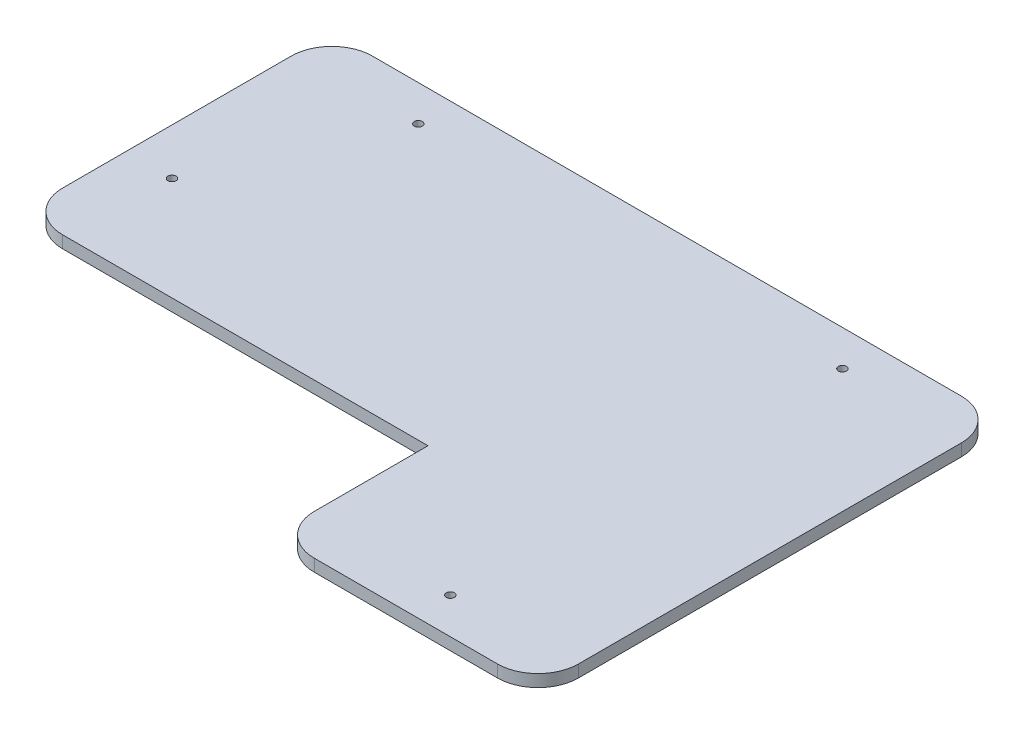
ISO-10303-21;
HEADER;
FILE_DESCRIPTION(('STEP AP214'),'2;1');
FILE_NAME('part.step','',(''),(''),'','','');
FILE_SCHEMA(('AUTOMOTIVE_DESIGN { 1 0 10303 214 1 1 1 1 }'));
ENDSEC;
DATA;
#1=APPLICATION_CONTEXT('core data for automotive mechanical design processes');
#2=APPLICATION_PROTOCOL_DEFINITION('international standard','automotive_design',2000,#1);
#3=PRODUCT_CONTEXT('',#1,'mechanical');
#4=PRODUCT('Part','Part','',(#3));
#5=PRODUCT_RELATED_PRODUCT_CATEGORY('part','',(#4));
#6=PRODUCT_DEFINITION_FORMATION('','',#4);
#7=PRODUCT_DEFINITION_CONTEXT('part definition',#1,'design');
#8=PRODUCT_DEFINITION('design','',#6,#7);
#9=PRODUCT_DEFINITION_SHAPE('','',#8);
#10=(LENGTH_UNIT() NAMED_UNIT(*) SI_UNIT(.MILLI.,.METRE.));
#11=(NAMED_UNIT(*) PLANE_ANGLE_UNIT() SI_UNIT($,.RADIAN.));
#12=(NAMED_UNIT(*) SI_UNIT($,.STERADIAN.) SOLID_ANGLE_UNIT());
#13=UNCERTAINTY_MEASURE_WITH_UNIT(LENGTH_MEASURE(1.E-05),#10,'distance_accuracy_value','');
#14=(GEOMETRIC_REPRESENTATION_CONTEXT(3) GLOBAL_UNCERTAINTY_ASSIGNED_CONTEXT((#13)) GLOBAL_UNIT_ASSIGNED_CONTEXT((#10,
#11,#12)) REPRESENTATION_CONTEXT('',''));
#15=CARTESIAN_POINT('',(0.,0.,0.));
#16=DIRECTION('',(0.,0.,1.));
#17=DIRECTION('',(1.,0.,0.));
#18=AXIS2_PLACEMENT_3D('',#15,#16,#17);
#19=CARTESIAN_POINT('',(-82.55,3.,-57.15));
#20=DIRECTION('',(1.,0.,0.));
#21=DIRECTION('',(0.,0.,-1.));
#22=AXIS2_PLACEMENT_3D('',#19,#20,#21);
#23=PLANE('',#22);
#24=DIRECTION('',(0.,0.,1.));
#25=VECTOR('',#24,1.);
#26=CARTESIAN_POINT('',(-82.55,0.,-57.15));
#27=LINE('',#26,#25);
#28=CARTESIAN_POINT('',(-82.55,0.,-47.15));
#29=VERTEX_POINT('',#28);
#30=CARTESIAN_POINT('',(-82.55,0.,9.15000000000001));
#31=VERTEX_POINT('',#30);
#32=EDGE_CURVE('E139',#29,#31,#27,.T.);
#33=ORIENTED_EDGE('',*,*,#32,.T.);
#34=DIRECTION('',(0.,1.,0.));
#35=VECTOR('',#34,1.);
#36=CARTESIAN_POINT('',(-82.55,3.,9.15000000000001));
#37=LINE('',#36,#35);
#38=CARTESIAN_POINT('',(-82.55,3.,9.15000000000001));
#39=VERTEX_POINT('',#38);
#40=EDGE_CURVE('E195',#31,#39,#37,.T.);
#41=ORIENTED_EDGE('',*,*,#40,.T.);
#42=DIRECTION('',(0.,0.,1.));
#43=VECTOR('',#42,1.);
#44=CARTESIAN_POINT('',(-82.55,3.,-57.15));
#45=LINE('',#44,#43);
#46=CARTESIAN_POINT('',(-82.55,3.,-47.15));
#47=VERTEX_POINT('',#46);
#48=EDGE_CURVE('E149',#47,#39,#45,.T.);
#49=ORIENTED_EDGE('',*,*,#48,.F.);
#50=DIRECTION('',(0.,-1.,0.));
#51=VECTOR('',#50,1.);
#52=CARTESIAN_POINT('',(-82.55,3.,-47.15));
#53=LINE('',#52,#51);
#54=EDGE_CURVE('E192',#47,#29,#53,.T.);
#55=ORIENTED_EDGE('',*,*,#54,.T.);
#56=EDGE_LOOP('',(#33,#41,#49,#55));
#57=FACE_BOUND('',#56,.T.);
#58=ADVANCED_FACE('F35',(#57),#23,.F.);
#59=CARTESIAN_POINT('',(82.55,3.,57.15));
#60=DIRECTION('',(0.,0.,-1.));
#61=DIRECTION('',(-1.,0.,0.));
#62=AXIS2_PLACEMENT_3D('',#59,#60,#61);
#63=PLANE('',#62);
#64=DIRECTION('',(1.,0.,0.));
#65=VECTOR('',#64,1.);
#66=CARTESIAN_POINT('',(82.55,3.,57.15));
#67=LINE('',#66,#65);
#68=CARTESIAN_POINT('',(27.45,3.,57.15));
#69=VERTEX_POINT('',#68);
#70=CARTESIAN_POINT('',(72.55,3.,57.15));
#71=VERTEX_POINT('',#70);
#72=EDGE_CURVE('E151',#69,#71,#67,.T.);
#73=ORIENTED_EDGE('',*,*,#72,.F.);
#74=DIRECTION('',(0.,1.,0.));
#75=VECTOR('',#74,1.);
#76=CARTESIAN_POINT('',(27.45,3.,57.15));
#77=LINE('',#76,#75);
#78=CARTESIAN_POINT('',(27.45,0.,57.15));
#79=VERTEX_POINT('',#78);
#80=EDGE_CURVE('E182',#69,#79,#77,.F.);
#81=ORIENTED_EDGE('',*,*,#80,.T.);
#82=DIRECTION('',(1.,0.,0.));
#83=VECTOR('',#82,1.);
#84=CARTESIAN_POINT('',(82.55,0.,57.15));
#85=LINE('',#84,#83);
#86=CARTESIAN_POINT('',(72.55,0.,57.15));
#87=VERTEX_POINT('',#86);
#88=EDGE_CURVE('E163',#79,#87,#85,.T.);
#89=ORIENTED_EDGE('',*,*,#88,.T.);
#90=DIRECTION('',(0.,-1.,0.));
#91=VECTOR('',#90,1.);
#92=CARTESIAN_POINT('',(72.55,3.,57.15));
#93=LINE('',#92,#91);
#94=EDGE_CURVE('E180',#87,#71,#93,.F.);
#95=ORIENTED_EDGE('',*,*,#94,.T.);
#96=EDGE_LOOP('',(#73,#81,#89,#95));
#97=FACE_BOUND('',#96,.T.);
#98=ADVANCED_FACE('F214',(#97),#63,.F.);
#99=CARTESIAN_POINT('',(82.55,3.,-57.15));
#100=DIRECTION('',(-1.,0.,0.));
#101=DIRECTION('',(0.,0.,1.));
#102=AXIS2_PLACEMENT_3D('',#99,#100,#101);
#103=PLANE('',#102);
#104=DIRECTION('',(0.,0.,-1.));
#105=VECTOR('',#104,1.);
#106=CARTESIAN_POINT('',(82.55,0.,-57.15));
#107=LINE('',#106,#105);
#108=CARTESIAN_POINT('',(82.55,0.,47.15));
#109=VERTEX_POINT('',#108);
#110=CARTESIAN_POINT('',(82.55,0.,-47.15));
#111=VERTEX_POINT('',#110);
#112=EDGE_CURVE('E166',#109,#111,#107,.T.);
#113=ORIENTED_EDGE('',*,*,#112,.T.);
#114=DIRECTION('',(0.,-1.,0.));
#115=VECTOR('',#114,1.);
#116=CARTESIAN_POINT('',(82.55,3.,-47.15));
#117=LINE('',#116,#115);
#118=CARTESIAN_POINT('',(82.55,3.,-47.15));
#119=VERTEX_POINT('',#118);
#120=EDGE_CURVE('E11',#111,#119,#117,.F.);
#121=ORIENTED_EDGE('',*,*,#120,.T.);
#122=DIRECTION('',(0.,0.,-1.));
#123=VECTOR('',#122,1.);
#124=CARTESIAN_POINT('',(82.55,3.,-57.15));
#125=LINE('',#124,#123);
#126=CARTESIAN_POINT('',(82.55,3.,47.15));
#127=VERTEX_POINT('',#126);
#128=EDGE_CURVE('E155',#127,#119,#125,.T.);
#129=ORIENTED_EDGE('',*,*,#128,.F.);
#130=DIRECTION('',(0.,-1.,0.));
#131=VECTOR('',#130,1.);
#132=CARTESIAN_POINT('',(82.55,3.,47.15));
#133=LINE('',#132,#131);
#134=EDGE_CURVE('E43',#127,#109,#133,.T.);
#135=ORIENTED_EDGE('',*,*,#134,.T.);
#136=EDGE_LOOP('',(#113,#121,#129,#135));
#137=FACE_BOUND('',#136,.T.);
#138=ADVANCED_FACE('F206',(#137),#103,.F.);
#139=CARTESIAN_POINT('',(82.55,3.,-57.15));
#140=DIRECTION('',(0.,0.,1.));
#141=DIRECTION('',(1.,0.,0.));
#142=AXIS2_PLACEMENT_3D('',#139,#140,#141);
#143=PLANE('',#142);
#144=DIRECTION('',(-1.,0.,0.));
#145=VECTOR('',#144,1.);
#146=CARTESIAN_POINT('',(82.55,3.,-57.15));
#147=LINE('',#146,#145);
#148=CARTESIAN_POINT('',(72.55,3.,-57.15));
#149=VERTEX_POINT('',#148);
#150=CARTESIAN_POINT('',(-72.55,3.,-57.15));
#151=VERTEX_POINT('',#150);
#152=EDGE_CURVE('E158',#149,#151,#147,.T.);
#153=ORIENTED_EDGE('',*,*,#152,.F.);
#154=DIRECTION('',(0.,-1.,0.));
#155=VECTOR('',#154,1.);
#156=CARTESIAN_POINT('',(72.55,3.,-57.15));
#157=LINE('',#156,#155);
#158=CARTESIAN_POINT('',(72.55,0.,-57.15));
#159=VERTEX_POINT('',#158);
#160=EDGE_CURVE('E202',#149,#159,#157,.T.);
#161=ORIENTED_EDGE('',*,*,#160,.T.);
#162=DIRECTION('',(-1.,0.,0.));
#163=VECTOR('',#162,1.);
#164=CARTESIAN_POINT('',(82.55,0.,-57.15));
#165=LINE('',#164,#163);
#166=CARTESIAN_POINT('',(-72.55,0.,-57.15));
#167=VERTEX_POINT('',#166);
#168=EDGE_CURVE('E152',#159,#167,#165,.T.);
#169=ORIENTED_EDGE('',*,*,#168,.T.);
#170=DIRECTION('',(0.,-1.,0.));
#171=VECTOR('',#170,1.);
#172=CARTESIAN_POINT('',(-72.55,3.,-57.15));
#173=LINE('',#172,#171);
#174=EDGE_CURVE('E200',#167,#151,#173,.F.);
#175=ORIENTED_EDGE('',*,*,#174,.T.);
#176=EDGE_LOOP('',(#153,#161,#169,#175));
#177=FACE_BOUND('',#176,.T.);
#178=ADVANCED_FACE('F233',(#177),#143,.F.);
#179=CARTESIAN_POINT('',(0.,3.,0.));
#180=DIRECTION('',(0.,-1.,0.));
#181=DIRECTION('',(0.,0.,-1.));
#182=AXIS2_PLACEMENT_3D('',#179,#180,#181);
#183=PLANE('',#182);
#184=CARTESIAN_POINT('',(52.07,3.,48.26));
#185=DIRECTION('',(0.,1.,0.));
#186=DIRECTION('',(0.,0.,1.));
#187=AXIS2_PLACEMENT_3D('',#184,#185,#186);
#188=CIRCLE('',#187,1.);
#189=CARTESIAN_POINT('',(52.07,3.,49.26));
#190=VERTEX_POINT('',#189);
#191=EDGE_CURVE('E371',#190,#190,#188,.T.);
#192=ORIENTED_EDGE('',*,*,#191,.F.);
#193=EDGE_LOOP('',(#192));
#194=FACE_BOUND('',#193,.T.);
#195=CARTESIAN_POINT('',(52.0699999999997,3.,-48.34));
#196=DIRECTION('',(0.,1.,0.));
#197=DIRECTION('',(0.,0.,1.));
#198=AXIS2_PLACEMENT_3D('',#195,#196,#197);
#199=CIRCLE('',#198,1.);
#200=CARTESIAN_POINT('',(52.0699999999997,3.,-47.34));
#201=VERTEX_POINT('',#200);
#202=EDGE_CURVE('E373',#201,#201,#199,.T.);
#203=ORIENTED_EDGE('',*,*,#202,.F.);
#204=EDGE_LOOP('',(#203));
#205=FACE_BOUND('',#204,.T.);
#206=CARTESIAN_POINT('',(-71.12,3.,-6.35000000000001));
#207=DIRECTION('',(0.,1.,0.));
#208=DIRECTION('',(0.,0.,1.));
#209=AXIS2_PLACEMENT_3D('',#206,#207,#208);
#210=CIRCLE('',#209,1.);
#211=CARTESIAN_POINT('',(-71.12,3.,-5.35000000000001));
#212=VERTEX_POINT('',#211);
#213=EDGE_CURVE('E385',#212,#212,#210,.T.);
#214=ORIENTED_EDGE('',*,*,#213,.F.);
#215=EDGE_LOOP('',(#214));
#216=FACE_BOUND('',#215,.T.);
#217=CARTESIAN_POINT('',(-52.4300000000003,3.,-48.3399999999993));
#218=DIRECTION('',(0.,1.,0.));
#219=DIRECTION('',(0.,0.,1.));
#220=AXIS2_PLACEMENT_3D('',#217,#218,#219);
#221=CIRCLE('',#220,1.);
#222=CARTESIAN_POINT('',(-52.4300000000003,3.,-47.3399999999993));
#223=VERTEX_POINT('',#222);
#224=EDGE_CURVE('E379',#223,#223,#221,.T.);
#225=ORIENTED_EDGE('',*,*,#224,.F.);
#226=EDGE_LOOP('',(#225));
#227=FACE_BOUND('',#226,.T.);
#228=DIRECTION('',(0.,0.,-1.));
#229=VECTOR('',#228,1.);
#230=CARTESIAN_POINT('',(17.45,3.,57.15));
#231=LINE('',#230,#229);
#232=CARTESIAN_POINT('',(17.45,3.,47.15));
#233=VERTEX_POINT('',#232);
#234=CARTESIAN_POINT('',(17.45,3.,19.15));
#235=VERTEX_POINT('',#234);
#236=EDGE_CURVE('E120',#233,#235,#231,.T.);
#237=ORIENTED_EDGE('',*,*,#236,.F.);
#238=CARTESIAN_POINT('',(27.45,3.,47.15));
#239=DIRECTION('',(0.,-1.,0.));
#240=DIRECTION('',(0.,0.,-1.));
#241=AXIS2_PLACEMENT_3D('',#238,#239,#240);
#242=CIRCLE('',#241,10.);
#243=EDGE_CURVE('E178',#233,#69,#242,.F.);
#244=ORIENTED_EDGE('',*,*,#243,.T.);
#245=ORIENTED_EDGE('',*,*,#72,.T.);
#246=CARTESIAN_POINT('',(72.55,3.,47.15));
#247=DIRECTION('',(0.,-1.,0.));
#248=DIRECTION('',(0.,0.,-1.));
#249=AXIS2_PLACEMENT_3D('',#246,#247,#248);
#250=CIRCLE('',#249,10.);
#251=EDGE_CURVE('E173',#71,#127,#250,.F.);
#252=ORIENTED_EDGE('',*,*,#251,.T.);
#253=ORIENTED_EDGE('',*,*,#128,.T.);
#254=CARTESIAN_POINT('',(72.55,3.,-47.15));
#255=DIRECTION('',(0.,-1.,0.));
#256=DIRECTION('',(0.,0.,-1.));
#257=AXIS2_PLACEMENT_3D('',#254,#255,#256);
#258=CIRCLE('',#257,10.);
#259=EDGE_CURVE('E175',#119,#149,#258,.F.);
#260=ORIENTED_EDGE('',*,*,#259,.T.);
#261=ORIENTED_EDGE('',*,*,#152,.T.);
#262=CARTESIAN_POINT('',(-72.55,3.,-47.15));
#263=DIRECTION('',(0.,-1.,0.));
#264=DIRECTION('',(0.,0.,-1.));
#265=AXIS2_PLACEMENT_3D('',#262,#263,#264);
#266=CIRCLE('',#265,10.);
#267=EDGE_CURVE('E171',#151,#47,#266,.F.);
#268=ORIENTED_EDGE('',*,*,#267,.T.);
#269=ORIENTED_EDGE('',*,*,#48,.T.);
#270=CARTESIAN_POINT('',(-72.55,3.,9.15000000000001));
#271=DIRECTION('',(0.,-1.,0.));
#272=DIRECTION('',(0.,0.,-1.));
#273=AXIS2_PLACEMENT_3D('',#270,#271,#272);
#274=CIRCLE('',#273,10.);
#275=CARTESIAN_POINT('',(-72.55,3.,19.15));
#276=VERTEX_POINT('',#275);
#277=EDGE_CURVE('E143',#39,#276,#274,.F.);
#278=ORIENTED_EDGE('',*,*,#277,.T.);
#279=DIRECTION('',(-1.,0.,0.));
#280=VECTOR('',#279,1.);
#281=CARTESIAN_POINT('',(-82.55,3.,19.15));
#282=LINE('',#281,#280);
#283=EDGE_CURVE('E129',#235,#276,#282,.T.);
#284=ORIENTED_EDGE('',*,*,#283,.F.);
#285=EDGE_LOOP('',(#237,#244,#245,#252,#253,#260,#261,#268,#269,#278,#284));
#286=FACE_BOUND('',#285,.T.);
#287=ADVANCED_FACE('F141',(#194,#205,#216,#227,#286),#183,.F.);
#288=CARTESIAN_POINT('',(0.,0.,0.));
#289=DIRECTION('',(0.,-1.,0.));
#290=DIRECTION('',(0.,0.,-1.));
#291=AXIS2_PLACEMENT_3D('',#288,#289,#290);
#292=PLANE('',#291);
#293=CARTESIAN_POINT('',(52.07,0.,48.26));
#294=DIRECTION('',(0.,1.,0.));
#295=DIRECTION('',(0.,0.,1.));
#296=AXIS2_PLACEMENT_3D('',#293,#294,#295);
#297=CIRCLE('',#296,1.);
#298=CARTESIAN_POINT('',(52.07,0.,49.26));
#299=VERTEX_POINT('',#298);
#300=EDGE_CURVE('E368',#299,#299,#297,.T.);
#301=ORIENTED_EDGE('',*,*,#300,.T.);
#302=EDGE_LOOP('',(#301));
#303=FACE_BOUND('',#302,.T.);
#304=CARTESIAN_POINT('',(52.0699999999997,0.,-48.34));
#305=DIRECTION('',(0.,1.,0.));
#306=DIRECTION('',(0.,0.,1.));
#307=AXIS2_PLACEMENT_3D('',#304,#305,#306);
#308=CIRCLE('',#307,1.);
#309=CARTESIAN_POINT('',(52.0699999999997,0.,-47.34));
#310=VERTEX_POINT('',#309);
#311=EDGE_CURVE('E390',#310,#310,#308,.T.);
#312=ORIENTED_EDGE('',*,*,#311,.T.);
#313=EDGE_LOOP('',(#312));
#314=FACE_BOUND('',#313,.T.);
#315=CARTESIAN_POINT('',(-71.12,0.,-6.35000000000001));
#316=DIRECTION('',(0.,1.,0.));
#317=DIRECTION('',(0.,0.,1.));
#318=AXIS2_PLACEMENT_3D('',#315,#316,#317);
#319=CIRCLE('',#318,1.);
#320=CARTESIAN_POINT('',(-71.12,0.,-5.35000000000001));
#321=VERTEX_POINT('',#320);
#322=EDGE_CURVE('E381',#321,#321,#319,.T.);
#323=ORIENTED_EDGE('',*,*,#322,.T.);
#324=EDGE_LOOP('',(#323));
#325=FACE_BOUND('',#324,.T.);
#326=CARTESIAN_POINT('',(-52.4300000000003,0.,-48.3399999999993));
#327=DIRECTION('',(0.,1.,0.));
#328=DIRECTION('',(0.,0.,1.));
#329=AXIS2_PLACEMENT_3D('',#326,#327,#328);
#330=CIRCLE('',#329,1.);
#331=CARTESIAN_POINT('',(-52.4300000000003,0.,-47.3399999999993));
#332=VERTEX_POINT('',#331);
#333=EDGE_CURVE('E130',#332,#332,#330,.T.);
#334=ORIENTED_EDGE('',*,*,#333,.T.);
#335=EDGE_LOOP('',(#334));
#336=FACE_BOUND('',#335,.T.);
#337=ORIENTED_EDGE('',*,*,#88,.F.);
#338=CARTESIAN_POINT('',(27.45,0.,47.15));
#339=DIRECTION('',(0.,-1.,0.));
#340=DIRECTION('',(0.,0.,-1.));
#341=AXIS2_PLACEMENT_3D('',#338,#339,#340);
#342=CIRCLE('',#341,10.);
#343=CARTESIAN_POINT('',(17.45,0.,47.15));
#344=VERTEX_POINT('',#343);
#345=EDGE_CURVE('E190',#79,#344,#342,.T.);
#346=ORIENTED_EDGE('',*,*,#345,.T.);
#347=DIRECTION('',(0.,0.,-1.));
#348=VECTOR('',#347,1.);
#349=CARTESIAN_POINT('',(17.45,0.,57.15));
#350=LINE('',#349,#348);
#351=CARTESIAN_POINT('',(17.45,0.,19.15));
#352=VERTEX_POINT('',#351);
#353=EDGE_CURVE('E144',#344,#352,#350,.T.);
#354=ORIENTED_EDGE('',*,*,#353,.T.);
#355=DIRECTION('',(-1.,0.,0.));
#356=VECTOR('',#355,1.);
#357=CARTESIAN_POINT('',(-82.55,0.,19.15));
#358=LINE('',#357,#356);
#359=CARTESIAN_POINT('',(-72.55,0.,19.15));
#360=VERTEX_POINT('',#359);
#361=EDGE_CURVE('E138',#352,#360,#358,.T.);
#362=ORIENTED_EDGE('',*,*,#361,.T.);
#363=CARTESIAN_POINT('',(-72.55,0.,9.15000000000001));
#364=DIRECTION('',(0.,-1.,0.));
#365=DIRECTION('',(0.,0.,-1.));
#366=AXIS2_PLACEMENT_3D('',#363,#364,#365);
#367=CIRCLE('',#366,10.);
#368=EDGE_CURVE('E188',#360,#31,#367,.T.);
#369=ORIENTED_EDGE('',*,*,#368,.T.);
#370=ORIENTED_EDGE('',*,*,#32,.F.);
#371=CARTESIAN_POINT('',(-72.55,0.,-47.15));
#372=DIRECTION('',(0.,-1.,0.));
#373=DIRECTION('',(0.,0.,-1.));
#374=AXIS2_PLACEMENT_3D('',#371,#372,#373);
#375=CIRCLE('',#374,10.);
#376=EDGE_CURVE('E184',#29,#167,#375,.T.);
#377=ORIENTED_EDGE('',*,*,#376,.T.);
#378=ORIENTED_EDGE('',*,*,#168,.F.);
#379=CARTESIAN_POINT('',(72.55,0.,-47.15));
#380=DIRECTION('',(0.,-1.,0.));
#381=DIRECTION('',(0.,0.,-1.));
#382=AXIS2_PLACEMENT_3D('',#379,#380,#381);
#383=CIRCLE('',#382,10.);
#384=EDGE_CURVE('E50',#159,#111,#383,.T.);
#385=ORIENTED_EDGE('',*,*,#384,.T.);
#386=ORIENTED_EDGE('',*,*,#112,.F.);
#387=CARTESIAN_POINT('',(72.55,0.,47.15));
#388=DIRECTION('',(0.,-1.,0.));
#389=DIRECTION('',(0.,0.,-1.));
#390=AXIS2_PLACEMENT_3D('',#387,#388,#389);
#391=CIRCLE('',#390,10.);
#392=EDGE_CURVE('E58',#109,#87,#391,.T.);
#393=ORIENTED_EDGE('',*,*,#392,.T.);
#394=EDGE_LOOP('',(#337,#346,#354,#362,#369,#370,#377,#378,#385,#386,#393));
#395=FACE_BOUND('',#394,.T.);
#396=ADVANCED_FACE('F210',(#303,#314,#325,#336,#395),#292,.T.);
#397=CARTESIAN_POINT('',(-82.55,0.,19.15));
#398=DIRECTION('',(0.,0.,-1.));
#399=DIRECTION('',(-1.,0.,0.));
#400=AXIS2_PLACEMENT_3D('',#397,#398,#399);
#401=PLANE('',#400);
#402=ORIENTED_EDGE('',*,*,#283,.T.);
#403=DIRECTION('',(0.,1.,0.));
#404=VECTOR('',#403,1.);
#405=CARTESIAN_POINT('',(-72.55,0.,19.15));
#406=LINE('',#405,#404);
#407=EDGE_CURVE('E198',#276,#360,#406,.F.);
#408=ORIENTED_EDGE('',*,*,#407,.T.);
#409=ORIENTED_EDGE('',*,*,#361,.F.);
#410=DIRECTION('',(0.,1.,0.));
#411=VECTOR('',#410,1.);
#412=CARTESIAN_POINT('',(17.45,0.,19.15));
#413=LINE('',#412,#411);
#414=EDGE_CURVE('E124',#352,#235,#413,.T.);
#415=ORIENTED_EDGE('',*,*,#414,.T.);
#416=EDGE_LOOP('',(#402,#408,#409,#415));
#417=FACE_BOUND('',#416,.T.);
#418=ADVANCED_FACE('F135',(#417),#401,.F.);
#419=CARTESIAN_POINT('',(17.45,0.,57.15));
#420=DIRECTION('',(1.,0.,0.));
#421=DIRECTION('',(0.,0.,-1.));
#422=AXIS2_PLACEMENT_3D('',#419,#420,#421);
#423=PLANE('',#422);
#424=ORIENTED_EDGE('',*,*,#353,.F.);
#425=DIRECTION('',(0.,1.,0.));
#426=VECTOR('',#425,1.);
#427=CARTESIAN_POINT('',(17.45,0.,47.15));
#428=LINE('',#427,#426);
#429=EDGE_CURVE('E126',#344,#233,#428,.T.);
#430=ORIENTED_EDGE('',*,*,#429,.T.);
#431=ORIENTED_EDGE('',*,*,#236,.T.);
#432=ORIENTED_EDGE('',*,*,#414,.F.);
#433=EDGE_LOOP('',(#424,#430,#431,#432));
#434=FACE_BOUND('',#433,.T.);
#435=ADVANCED_FACE('F123',(#434),#423,.F.);
#436=CARTESIAN_POINT('',(27.45,0.,47.15));
#437=DIRECTION('',(0.,1.,0.));
#438=DIRECTION('',(0.,0.,1.));
#439=AXIS2_PLACEMENT_3D('',#436,#437,#438);
#440=CYLINDRICAL_SURFACE('',#439,10.);
#441=ORIENTED_EDGE('',*,*,#345,.F.);
#442=ORIENTED_EDGE('',*,*,#80,.F.);
#443=ORIENTED_EDGE('',*,*,#243,.F.);
#444=ORIENTED_EDGE('',*,*,#429,.F.);
#445=EDGE_LOOP('',(#441,#442,#443,#444));
#446=FACE_BOUND('',#445,.T.);
#447=ADVANCED_FACE('F219',(#446),#440,.T.);
#448=CARTESIAN_POINT('',(-72.55,3.,9.15000000000001));
#449=DIRECTION('',(0.,1.,0.));
#450=DIRECTION('',(0.,0.,1.));
#451=AXIS2_PLACEMENT_3D('',#448,#449,#450);
#452=CYLINDRICAL_SURFACE('',#451,10.);
#453=ORIENTED_EDGE('',*,*,#368,.F.);
#454=ORIENTED_EDGE('',*,*,#407,.F.);
#455=ORIENTED_EDGE('',*,*,#277,.F.);
#456=ORIENTED_EDGE('',*,*,#40,.F.);
#457=EDGE_LOOP('',(#453,#454,#455,#456));
#458=FACE_BOUND('',#457,.T.);
#459=ADVANCED_FACE('F224',(#458),#452,.T.);
#460=CARTESIAN_POINT('',(72.55,3.,-47.15));
#461=DIRECTION('',(0.,-1.,0.));
#462=DIRECTION('',(0.,0.,-1.));
#463=AXIS2_PLACEMENT_3D('',#460,#461,#462);
#464=CYLINDRICAL_SURFACE('',#463,10.);
#465=ORIENTED_EDGE('',*,*,#259,.F.);
#466=ORIENTED_EDGE('',*,*,#120,.F.);
#467=ORIENTED_EDGE('',*,*,#384,.F.);
#468=ORIENTED_EDGE('',*,*,#160,.F.);
#469=EDGE_LOOP('',(#465,#466,#467,#468));
#470=FACE_BOUND('',#469,.T.);
#471=ADVANCED_FACE('F236',(#470),#464,.T.);
#472=CARTESIAN_POINT('',(72.55,3.,47.15));
#473=DIRECTION('',(0.,-1.,0.));
#474=DIRECTION('',(0.,0.,-1.));
#475=AXIS2_PLACEMENT_3D('',#472,#473,#474);
#476=CYLINDRICAL_SURFACE('',#475,10.);
#477=ORIENTED_EDGE('',*,*,#251,.F.);
#478=ORIENTED_EDGE('',*,*,#94,.F.);
#479=ORIENTED_EDGE('',*,*,#392,.F.);
#480=ORIENTED_EDGE('',*,*,#134,.F.);
#481=EDGE_LOOP('',(#477,#478,#479,#480));
#482=FACE_BOUND('',#481,.T.);
#483=ADVANCED_FACE('F216',(#482),#476,.T.);
#484=CARTESIAN_POINT('',(-72.55,3.,-47.15));
#485=DIRECTION('',(0.,-1.,0.));
#486=DIRECTION('',(0.,0.,-1.));
#487=AXIS2_PLACEMENT_3D('',#484,#485,#486);
#488=CYLINDRICAL_SURFACE('',#487,10.);
#489=ORIENTED_EDGE('',*,*,#267,.F.);
#490=ORIENTED_EDGE('',*,*,#174,.F.);
#491=ORIENTED_EDGE('',*,*,#376,.F.);
#492=ORIENTED_EDGE('',*,*,#54,.F.);
#493=EDGE_LOOP('',(#489,#490,#491,#492));
#494=FACE_BOUND('',#493,.T.);
#495=ADVANCED_FACE('F37',(#494),#488,.T.);
#496=CARTESIAN_POINT('',(-52.4300000000003,0.,-48.3399999999993));
#497=DIRECTION('',(0.,1.,0.));
#498=DIRECTION('',(0.,0.,1.));
#499=AXIS2_PLACEMENT_3D('',#496,#497,#498);
#500=CYLINDRICAL_SURFACE('',#499,1.);
#501=ORIENTED_EDGE('',*,*,#333,.F.);
#502=EDGE_LOOP('',(#501));
#503=FACE_BOUND('',#502,.T.);
#504=ORIENTED_EDGE('',*,*,#224,.T.);
#505=EDGE_LOOP('',(#504));
#506=FACE_BOUND('',#505,.T.);
#507=ADVANCED_FACE('F324',(#503,#506),#500,.F.);
#508=CARTESIAN_POINT('',(-71.12,0.,-6.35000000000001));
#509=DIRECTION('',(0.,1.,0.));
#510=DIRECTION('',(0.,0.,1.));
#511=AXIS2_PLACEMENT_3D('',#508,#509,#510);
#512=CYLINDRICAL_SURFACE('',#511,1.);
#513=ORIENTED_EDGE('',*,*,#322,.F.);
#514=EDGE_LOOP('',(#513));
#515=FACE_BOUND('',#514,.T.);
#516=ORIENTED_EDGE('',*,*,#213,.T.);
#517=EDGE_LOOP('',(#516));
#518=FACE_BOUND('',#517,.T.);
#519=ADVANCED_FACE('F332',(#515,#518),#512,.F.);
#520=CARTESIAN_POINT('',(52.0699999999997,0.,-48.34));
#521=DIRECTION('',(0.,1.,0.));
#522=DIRECTION('',(0.,0.,1.));
#523=AXIS2_PLACEMENT_3D('',#520,#521,#522);
#524=CYLINDRICAL_SURFACE('',#523,1.);
#525=ORIENTED_EDGE('',*,*,#311,.F.);
#526=EDGE_LOOP('',(#525));
#527=FACE_BOUND('',#526,.T.);
#528=ORIENTED_EDGE('',*,*,#202,.T.);
#529=EDGE_LOOP('',(#528));
#530=FACE_BOUND('',#529,.T.);
#531=ADVANCED_FACE('F338',(#527,#530),#524,.F.);
#532=CARTESIAN_POINT('',(52.07,0.,48.26));
#533=DIRECTION('',(0.,1.,0.));
#534=DIRECTION('',(0.,0.,1.));
#535=AXIS2_PLACEMENT_3D('',#532,#533,#534);
#536=CYLINDRICAL_SURFACE('',#535,1.);
#537=ORIENTED_EDGE('',*,*,#300,.F.);
#538=EDGE_LOOP('',(#537));
#539=FACE_BOUND('',#538,.T.);
#540=ORIENTED_EDGE('',*,*,#191,.T.);
#541=EDGE_LOOP('',(#540));
#542=FACE_BOUND('',#541,.T.);
#543=ADVANCED_FACE('F346',(#539,#542),#536,.F.);
#544=CLOSED_SHELL('',(#58,#98,#138,#178,#287,#396,#418,#435,#447,#459,#471,#483,#495,#507,#519,
#531,#543));
#545=MANIFOLD_SOLID_BREP('B2',#544);
#546=ADVANCED_BREP_SHAPE_REPRESENTATION('',(#18,#545),#14);
#547=SHAPE_DEFINITION_REPRESENTATION(#9,#546);
ENDSEC;
END-ISO-10303-21;
